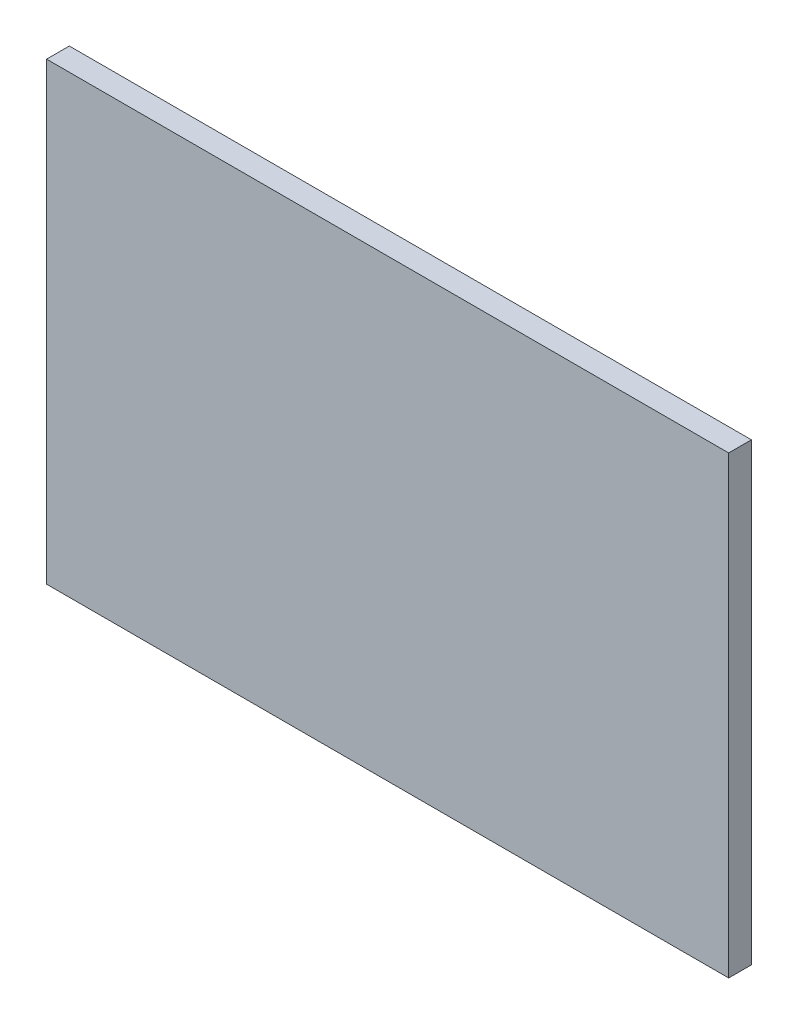
ISO-10303-21;
HEADER;
FILE_DESCRIPTION(('STEP AP214'),'2;1');
FILE_NAME('part.step','',(''),(''),'','','');
FILE_SCHEMA(('AUTOMOTIVE_DESIGN { 1 0 10303 214 1 1 1 1 }'));
ENDSEC;
DATA;
#1=APPLICATION_CONTEXT('core data for automotive mechanical design processes');
#2=APPLICATION_PROTOCOL_DEFINITION('international standard','automotive_design',2000,#1);
#3=PRODUCT_CONTEXT('',#1,'mechanical');
#4=PRODUCT('Part','Part','',(#3));
#5=PRODUCT_RELATED_PRODUCT_CATEGORY('part','',(#4));
#6=PRODUCT_DEFINITION_FORMATION('','',#4);
#7=PRODUCT_DEFINITION_CONTEXT('part definition',#1,'design');
#8=PRODUCT_DEFINITION('design','',#6,#7);
#9=PRODUCT_DEFINITION_SHAPE('','',#8);
#10=(LENGTH_UNIT() NAMED_UNIT(*) SI_UNIT(.MILLI.,.METRE.));
#11=(NAMED_UNIT(*) PLANE_ANGLE_UNIT() SI_UNIT($,.RADIAN.));
#12=(NAMED_UNIT(*) SI_UNIT($,.STERADIAN.) SOLID_ANGLE_UNIT());
#13=UNCERTAINTY_MEASURE_WITH_UNIT(LENGTH_MEASURE(1.E-05),#10,'distance_accuracy_value','');
#14=(GEOMETRIC_REPRESENTATION_CONTEXT(3) GLOBAL_UNCERTAINTY_ASSIGNED_CONTEXT((#13)) GLOBAL_UNIT_ASSIGNED_CONTEXT((#10,
#11,#12)) REPRESENTATION_CONTEXT('',''));
#15=CARTESIAN_POINT('',(0.,0.,0.));
#16=DIRECTION('',(0.,0.,1.));
#17=DIRECTION('',(1.,0.,0.));
#18=AXIS2_PLACEMENT_3D('',#15,#16,#17);
#19=CARTESIAN_POINT('',(0.,0.,0.01));
#20=DIRECTION('',(0.,0.,1.));
#21=DIRECTION('',(1.,0.,0.));
#22=AXIS2_PLACEMENT_3D('',#19,#20,#21);
#23=PLANE('',#22);
#24=DIRECTION('',(0.,1.,0.));
#25=VECTOR('',#24,1.);
#26=CARTESIAN_POINT('',(0.,0.,0.01));
#27=LINE('',#26,#25);
#28=CARTESIAN_POINT('',(0.,0.,0.01));
#29=VERTEX_POINT('',#28);
#30=CARTESIAN_POINT('',(0.,0.2,0.01));
#31=VERTEX_POINT('',#30);
#32=EDGE_CURVE('E66',#29,#31,#27,.T.);
#33=ORIENTED_EDGE('',*,*,#32,.F.);
#34=DIRECTION('',(1.,0.,0.));
#35=VECTOR('',#34,1.);
#36=CARTESIAN_POINT('',(0.,0.,0.01));
#37=LINE('',#36,#35);
#38=CARTESIAN_POINT('',(0.3,0.,0.01));
#39=VERTEX_POINT('',#38);
#40=EDGE_CURVE('E97',#29,#39,#37,.T.);
#41=ORIENTED_EDGE('',*,*,#40,.T.);
#42=DIRECTION('',(0.,1.,0.));
#43=VECTOR('',#42,1.);
#44=CARTESIAN_POINT('',(0.3,0.,0.01));
#45=LINE('',#44,#43);
#46=CARTESIAN_POINT('',(0.3,0.2,0.01));
#47=VERTEX_POINT('',#46);
#48=EDGE_CURVE('E69',#39,#47,#45,.T.);
#49=ORIENTED_EDGE('',*,*,#48,.T.);
#50=DIRECTION('',(1.,0.,0.));
#51=VECTOR('',#50,1.);
#52=CARTESIAN_POINT('',(0.,0.2,0.01));
#53=LINE('',#52,#51);
#54=EDGE_CURVE('E11',#31,#47,#53,.T.);
#55=ORIENTED_EDGE('',*,*,#54,.F.);
#56=EDGE_LOOP('',(#33,#41,#49,#55));
#57=FACE_BOUND('',#56,.T.);
#58=ADVANCED_FACE('F16',(#57),#23,.T.);
#59=CARTESIAN_POINT('',(0.,0.,0.));
#60=DIRECTION('',(0.,0.,1.));
#61=DIRECTION('',(1.,0.,0.));
#62=AXIS2_PLACEMENT_3D('',#59,#60,#61);
#63=PLANE('',#62);
#64=DIRECTION('',(0.,1.,0.));
#65=VECTOR('',#64,1.);
#66=CARTESIAN_POINT('',(0.,0.,0.));
#67=LINE('',#66,#65);
#68=CARTESIAN_POINT('',(0.,0.,0.));
#69=VERTEX_POINT('',#68);
#70=CARTESIAN_POINT('',(0.,0.2,0.));
#71=VERTEX_POINT('',#70);
#72=EDGE_CURVE('E77',#69,#71,#67,.T.);
#73=ORIENTED_EDGE('',*,*,#72,.T.);
#74=DIRECTION('',(1.,0.,0.));
#75=VECTOR('',#74,1.);
#76=CARTESIAN_POINT('',(0.,0.2,0.));
#77=LINE('',#76,#75);
#78=CARTESIAN_POINT('',(0.3,0.2,0.));
#79=VERTEX_POINT('',#78);
#80=EDGE_CURVE('E27',#71,#79,#77,.T.);
#81=ORIENTED_EDGE('',*,*,#80,.T.);
#82=DIRECTION('',(0.,1.,0.));
#83=VECTOR('',#82,1.);
#84=CARTESIAN_POINT('',(0.3,0.,0.));
#85=LINE('',#84,#83);
#86=CARTESIAN_POINT('',(0.3,0.,0.));
#87=VERTEX_POINT('',#86);
#88=EDGE_CURVE('E90',#87,#79,#85,.T.);
#89=ORIENTED_EDGE('',*,*,#88,.F.);
#90=DIRECTION('',(1.,0.,0.));
#91=VECTOR('',#90,1.);
#92=CARTESIAN_POINT('',(0.,0.,0.));
#93=LINE('',#92,#91);
#94=EDGE_CURVE('E99',#69,#87,#93,.T.);
#95=ORIENTED_EDGE('',*,*,#94,.F.);
#96=EDGE_LOOP('',(#73,#81,#89,#95));
#97=FACE_BOUND('',#96,.T.);
#98=ADVANCED_FACE('F108',(#97),#63,.F.);
#99=CARTESIAN_POINT('',(0.,0.2,0.));
#100=DIRECTION('',(0.,1.,0.));
#101=DIRECTION('',(1.,0.,0.));
#102=AXIS2_PLACEMENT_3D('',#99,#100,#101);
#103=PLANE('',#102);
#104=ORIENTED_EDGE('',*,*,#80,.F.);
#105=DIRECTION('',(0.,0.,1.));
#106=VECTOR('',#105,1.);
#107=CARTESIAN_POINT('',(0.,0.2,0.));
#108=LINE('',#107,#106);
#109=EDGE_CURVE('E72',#71,#31,#108,.T.);
#110=ORIENTED_EDGE('',*,*,#109,.T.);
#111=ORIENTED_EDGE('',*,*,#54,.T.);
#112=DIRECTION('',(0.,0.,1.));
#113=VECTOR('',#112,1.);
#114=CARTESIAN_POINT('',(0.3,0.2,0.));
#115=LINE('',#114,#113);
#116=EDGE_CURVE('E20',#79,#47,#115,.T.);
#117=ORIENTED_EDGE('',*,*,#116,.F.);
#118=EDGE_LOOP('',(#104,#110,#111,#117));
#119=FACE_BOUND('',#118,.T.);
#120=ADVANCED_FACE('F18',(#119),#103,.T.);
#121=CARTESIAN_POINT('',(0.,0.,0.));
#122=DIRECTION('',(0.,1.,0.));
#123=DIRECTION('',(1.,0.,0.));
#124=AXIS2_PLACEMENT_3D('',#121,#122,#123);
#125=PLANE('',#124);
#126=ORIENTED_EDGE('',*,*,#94,.T.);
#127=DIRECTION('',(0.,0.,1.));
#128=VECTOR('',#127,1.);
#129=CARTESIAN_POINT('',(0.3,0.,0.));
#130=LINE('',#129,#128);
#131=EDGE_CURVE('E93',#87,#39,#130,.T.);
#132=ORIENTED_EDGE('',*,*,#131,.T.);
#133=ORIENTED_EDGE('',*,*,#40,.F.);
#134=DIRECTION('',(0.,0.,1.));
#135=VECTOR('',#134,1.);
#136=CARTESIAN_POINT('',(0.,0.,0.));
#137=LINE('',#136,#135);
#138=EDGE_CURVE('E81',#69,#29,#137,.T.);
#139=ORIENTED_EDGE('',*,*,#138,.F.);
#140=EDGE_LOOP('',(#126,#132,#133,#139));
#141=FACE_BOUND('',#140,.T.);
#142=ADVANCED_FACE('F163',(#141),#125,.F.);
#143=CARTESIAN_POINT('',(0.3,0.,0.));
#144=DIRECTION('',(1.,0.,0.));
#145=DIRECTION('',(0.,1.,0.));
#146=AXIS2_PLACEMENT_3D('',#143,#144,#145);
#147=PLANE('',#146);
#148=ORIENTED_EDGE('',*,*,#131,.F.);
#149=ORIENTED_EDGE('',*,*,#88,.T.);
#150=ORIENTED_EDGE('',*,*,#116,.T.);
#151=ORIENTED_EDGE('',*,*,#48,.F.);
#152=EDGE_LOOP('',(#148,#149,#150,#151));
#153=FACE_BOUND('',#152,.T.);
#154=ADVANCED_FACE('F113',(#153),#147,.T.);
#155=CARTESIAN_POINT('',(0.,0.,0.));
#156=DIRECTION('',(1.,0.,0.));
#157=DIRECTION('',(0.,1.,0.));
#158=AXIS2_PLACEMENT_3D('',#155,#156,#157);
#159=PLANE('',#158);
#160=ORIENTED_EDGE('',*,*,#138,.T.);
#161=ORIENTED_EDGE('',*,*,#32,.T.);
#162=ORIENTED_EDGE('',*,*,#109,.F.);
#163=ORIENTED_EDGE('',*,*,#72,.F.);
#164=EDGE_LOOP('',(#160,#161,#162,#163));
#165=FACE_BOUND('',#164,.T.);
#166=ADVANCED_FACE('F79',(#165),#159,.F.);
#167=CLOSED_SHELL('',(#58,#98,#120,#142,#154,#166));
#168=MANIFOLD_SOLID_BREP('B1',#167);
#169=ADVANCED_BREP_SHAPE_REPRESENTATION('',(#18,#168),#14);
#170=SHAPE_DEFINITION_REPRESENTATION(#9,#169);
ENDSEC;
END-ISO-10303-21;
